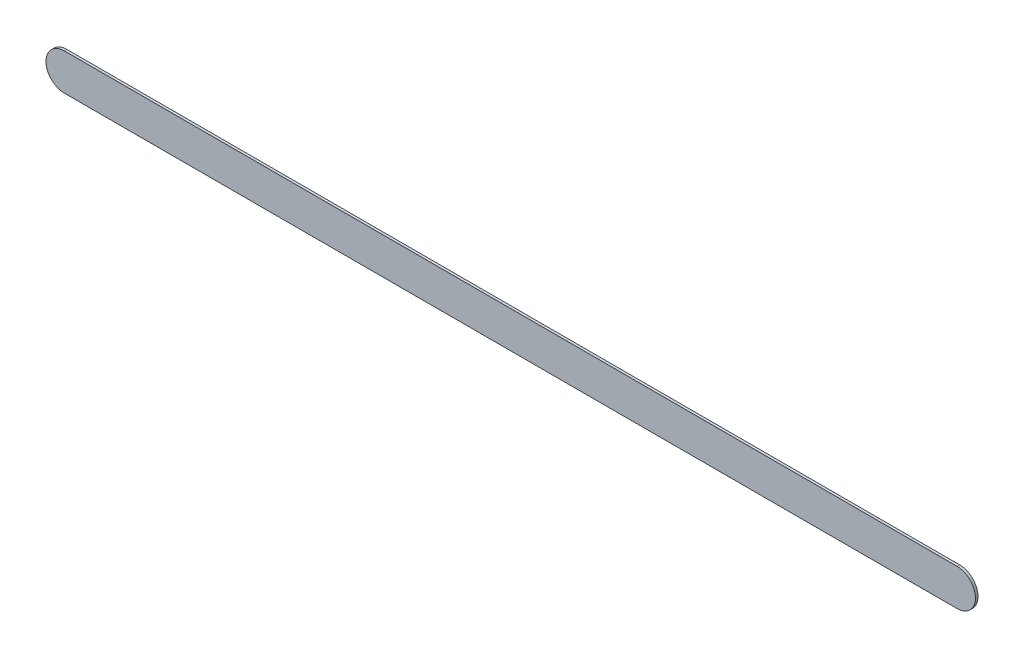
ISO-10303-21;
HEADER;
FILE_DESCRIPTION(('STEP AP214'),'2;1');
FILE_NAME('part.step','',(''),(''),'','','');
FILE_SCHEMA(('AUTOMOTIVE_DESIGN { 1 0 10303 214 1 1 1 1 }'));
ENDSEC;
DATA;
#1=APPLICATION_CONTEXT('core data for automotive mechanical design processes');
#2=APPLICATION_PROTOCOL_DEFINITION('international standard','automotive_design',2000,#1);
#3=PRODUCT_CONTEXT('',#1,'mechanical');
#4=PRODUCT('Part','Part','',(#3));
#5=PRODUCT_RELATED_PRODUCT_CATEGORY('part','',(#4));
#6=PRODUCT_DEFINITION_FORMATION('','',#4);
#7=PRODUCT_DEFINITION_CONTEXT('part definition',#1,'design');
#8=PRODUCT_DEFINITION('design','',#6,#7);
#9=PRODUCT_DEFINITION_SHAPE('','',#8);
#10=(LENGTH_UNIT() NAMED_UNIT(*) SI_UNIT(.MILLI.,.METRE.));
#11=(NAMED_UNIT(*) PLANE_ANGLE_UNIT() SI_UNIT($,.RADIAN.));
#12=(NAMED_UNIT(*) SI_UNIT($,.STERADIAN.) SOLID_ANGLE_UNIT());
#13=UNCERTAINTY_MEASURE_WITH_UNIT(LENGTH_MEASURE(1.E-05),#10,'distance_accuracy_value','');
#14=(GEOMETRIC_REPRESENTATION_CONTEXT(3) GLOBAL_UNCERTAINTY_ASSIGNED_CONTEXT((#13)) GLOBAL_UNIT_ASSIGNED_CONTEXT((#10,
#11,#12)) REPRESENTATION_CONTEXT('',''));
#15=CARTESIAN_POINT('',(0.,0.,0.));
#16=DIRECTION('',(0.,0.,1.));
#17=DIRECTION('',(1.,0.,0.));
#18=AXIS2_PLACEMENT_3D('',#15,#16,#17);
#19=CARTESIAN_POINT('',(174.752,-85.094,0.));
#20=DIRECTION('',(0.,0.,1.));
#21=DIRECTION('',(1.,0.,0.));
#22=AXIS2_PLACEMENT_3D('',#19,#20,#21);
#23=PLANE('',#22);
#24=DIRECTION('',(-1.,0.,0.));
#25=VECTOR('',#24,1.);
#26=CARTESIAN_POINT('',(174.752,-85.094,0.));
#27=LINE('',#26,#25);
#28=CARTESIAN_POINT('',(174.752,-85.094,0.));
#29=VERTEX_POINT('',#28);
#30=CARTESIAN_POINT('',(162.56,-85.094,0.));
#31=VERTEX_POINT('',#30);
#32=EDGE_CURVE('E97',#29,#31,#27,.T.);
#33=ORIENTED_EDGE('',*,*,#32,.T.);
#34=CARTESIAN_POINT('',(162.56,-85.344,0.));
#35=DIRECTION('',(0.,0.,1.));
#36=DIRECTION('',(0.,1.,0.));
#37=AXIS2_PLACEMENT_3D('',#34,#35,#36);
#38=CIRCLE('',#37,0.25);
#39=CARTESIAN_POINT('',(162.56,-85.594,0.));
#40=VERTEX_POINT('',#39);
#41=EDGE_CURVE('E76',#31,#40,#38,.T.);
#42=ORIENTED_EDGE('',*,*,#41,.T.);
#43=DIRECTION('',(1.,0.,0.));
#44=VECTOR('',#43,1.);
#45=CARTESIAN_POINT('',(162.56,-85.594,0.));
#46=LINE('',#45,#44);
#47=CARTESIAN_POINT('',(174.752,-85.594,0.));
#48=VERTEX_POINT('',#47);
#49=EDGE_CURVE('E81',#40,#48,#46,.T.);
#50=ORIENTED_EDGE('',*,*,#49,.T.);
#51=CARTESIAN_POINT('',(174.752,-85.344,0.));
#52=DIRECTION('',(0.,0.,1.));
#53=DIRECTION('',(0.,-1.,0.));
#54=AXIS2_PLACEMENT_3D('',#51,#52,#53);
#55=CIRCLE('',#54,0.25);
#56=EDGE_CURVE('E11',#48,#29,#55,.T.);
#57=ORIENTED_EDGE('',*,*,#56,.T.);
#58=EDGE_LOOP('',(#33,#42,#50,#57));
#59=FACE_BOUND('',#58,.T.);
#60=ADVANCED_FACE('F17',(#59),#23,.T.);
#61=CARTESIAN_POINT('',(174.752,-85.094,-0.035));
#62=DIRECTION('',(0.,0.,1.));
#63=DIRECTION('',(1.,0.,0.));
#64=AXIS2_PLACEMENT_3D('',#61,#62,#63);
#65=PLANE('',#64);
#66=CARTESIAN_POINT('',(174.752,-85.344,-0.035));
#67=DIRECTION('',(0.,0.,1.));
#68=DIRECTION('',(0.,-1.,0.));
#69=AXIS2_PLACEMENT_3D('',#66,#67,#68);
#70=CIRCLE('',#69,0.25);
#71=CARTESIAN_POINT('',(174.752,-85.594,-0.035));
#72=VERTEX_POINT('',#71);
#73=CARTESIAN_POINT('',(174.752,-85.094,-0.035));
#74=VERTEX_POINT('',#73);
#75=EDGE_CURVE('E25',#72,#74,#70,.T.);
#76=ORIENTED_EDGE('',*,*,#75,.F.);
#77=DIRECTION('',(1.,0.,0.));
#78=VECTOR('',#77,1.);
#79=CARTESIAN_POINT('',(162.56,-85.594,-0.035));
#80=LINE('',#79,#78);
#81=CARTESIAN_POINT('',(162.56,-85.594,-0.035));
#82=VERTEX_POINT('',#81);
#83=EDGE_CURVE('E66',#82,#72,#80,.T.);
#84=ORIENTED_EDGE('',*,*,#83,.F.);
#85=CARTESIAN_POINT('',(162.56,-85.344,-0.035));
#86=DIRECTION('',(0.,0.,1.));
#87=DIRECTION('',(0.,1.,0.));
#88=AXIS2_PLACEMENT_3D('',#85,#86,#87);
#89=CIRCLE('',#88,0.25);
#90=CARTESIAN_POINT('',(162.56,-85.094,-0.035));
#91=VERTEX_POINT('',#90);
#92=EDGE_CURVE('E70',#91,#82,#89,.T.);
#93=ORIENTED_EDGE('',*,*,#92,.F.);
#94=DIRECTION('',(-1.,0.,0.));
#95=VECTOR('',#94,1.);
#96=CARTESIAN_POINT('',(174.752,-85.094,-0.035));
#97=LINE('',#96,#95);
#98=EDGE_CURVE('E100',#74,#91,#97,.T.);
#99=ORIENTED_EDGE('',*,*,#98,.F.);
#100=EDGE_LOOP('',(#76,#84,#93,#99));
#101=FACE_BOUND('',#100,.T.);
#102=ADVANCED_FACE('F68',(#101),#65,.F.);
#103=CARTESIAN_POINT('',(174.752,-85.344,-0.035));
#104=DIRECTION('',(0.,0.,-1.));
#105=DIRECTION('',(0.,-1.,0.));
#106=AXIS2_PLACEMENT_3D('',#103,#104,#105);
#107=CYLINDRICAL_SURFACE('',#106,0.25);
#108=ORIENTED_EDGE('',*,*,#75,.T.);
#109=DIRECTION('',(0.,0.,1.));
#110=VECTOR('',#109,1.);
#111=CARTESIAN_POINT('',(174.752,-85.094,-0.035));
#112=LINE('',#111,#110);
#113=EDGE_CURVE('E91',#74,#29,#112,.T.);
#114=ORIENTED_EDGE('',*,*,#113,.T.);
#115=ORIENTED_EDGE('',*,*,#56,.F.);
#116=DIRECTION('',(0.,0.,1.));
#117=VECTOR('',#116,1.);
#118=CARTESIAN_POINT('',(174.752,-85.594,-0.035));
#119=LINE('',#118,#117);
#120=EDGE_CURVE('E75',#72,#48,#119,.T.);
#121=ORIENTED_EDGE('',*,*,#120,.F.);
#122=EDGE_LOOP('',(#108,#114,#115,#121));
#123=FACE_BOUND('',#122,.T.);
#124=ADVANCED_FACE('F117',(#123),#107,.T.);
#125=CARTESIAN_POINT('',(162.56,-85.594,-0.035));
#126=DIRECTION('',(0.,1.,0.));
#127=DIRECTION('',(1.,0.,0.));
#128=AXIS2_PLACEMENT_3D('',#125,#126,#127);
#129=PLANE('',#128);
#130=ORIENTED_EDGE('',*,*,#83,.T.);
#131=ORIENTED_EDGE('',*,*,#120,.T.);
#132=ORIENTED_EDGE('',*,*,#49,.F.);
#133=DIRECTION('',(0.,0.,1.));
#134=VECTOR('',#133,1.);
#135=CARTESIAN_POINT('',(162.56,-85.594,-0.035));
#136=LINE('',#135,#134);
#137=EDGE_CURVE('E79',#82,#40,#136,.T.);
#138=ORIENTED_EDGE('',*,*,#137,.F.);
#139=EDGE_LOOP('',(#130,#131,#132,#138));
#140=FACE_BOUND('',#139,.T.);
#141=ADVANCED_FACE('F80',(#140),#129,.F.);
#142=CARTESIAN_POINT('',(162.56,-85.344,-0.035));
#143=DIRECTION('',(0.,0.,-1.));
#144=DIRECTION('',(0.,1.,0.));
#145=AXIS2_PLACEMENT_3D('',#142,#143,#144);
#146=CYLINDRICAL_SURFACE('',#145,0.25);
#147=ORIENTED_EDGE('',*,*,#92,.T.);
#148=ORIENTED_EDGE('',*,*,#137,.T.);
#149=ORIENTED_EDGE('',*,*,#41,.F.);
#150=DIRECTION('',(0.,0.,1.));
#151=VECTOR('',#150,1.);
#152=CARTESIAN_POINT('',(162.56,-85.094,-0.035));
#153=LINE('',#152,#151);
#154=EDGE_CURVE('E88',#91,#31,#153,.T.);
#155=ORIENTED_EDGE('',*,*,#154,.F.);
#156=EDGE_LOOP('',(#147,#148,#149,#155));
#157=FACE_BOUND('',#156,.T.);
#158=ADVANCED_FACE('F86',(#157),#146,.T.);
#159=CARTESIAN_POINT('',(174.752,-85.094,-0.035));
#160=DIRECTION('',(0.,-1.,0.));
#161=DIRECTION('',(0.,0.,-1.));
#162=AXIS2_PLACEMENT_3D('',#159,#160,#161);
#163=PLANE('',#162);
#164=ORIENTED_EDGE('',*,*,#98,.T.);
#165=ORIENTED_EDGE('',*,*,#154,.T.);
#166=ORIENTED_EDGE('',*,*,#32,.F.);
#167=ORIENTED_EDGE('',*,*,#113,.F.);
#168=EDGE_LOOP('',(#164,#165,#166,#167));
#169=FACE_BOUND('',#168,.T.);
#170=ADVANCED_FACE('F120',(#169),#163,.F.);
#171=CLOSED_SHELL('',(#60,#102,#124,#141,#158,#170));
#172=MANIFOLD_SOLID_BREP('B1',#171);
#173=ADVANCED_BREP_SHAPE_REPRESENTATION('',(#18,#172),#14);
#174=SHAPE_DEFINITION_REPRESENTATION(#9,#173);
ENDSEC;
END-ISO-10303-21;
